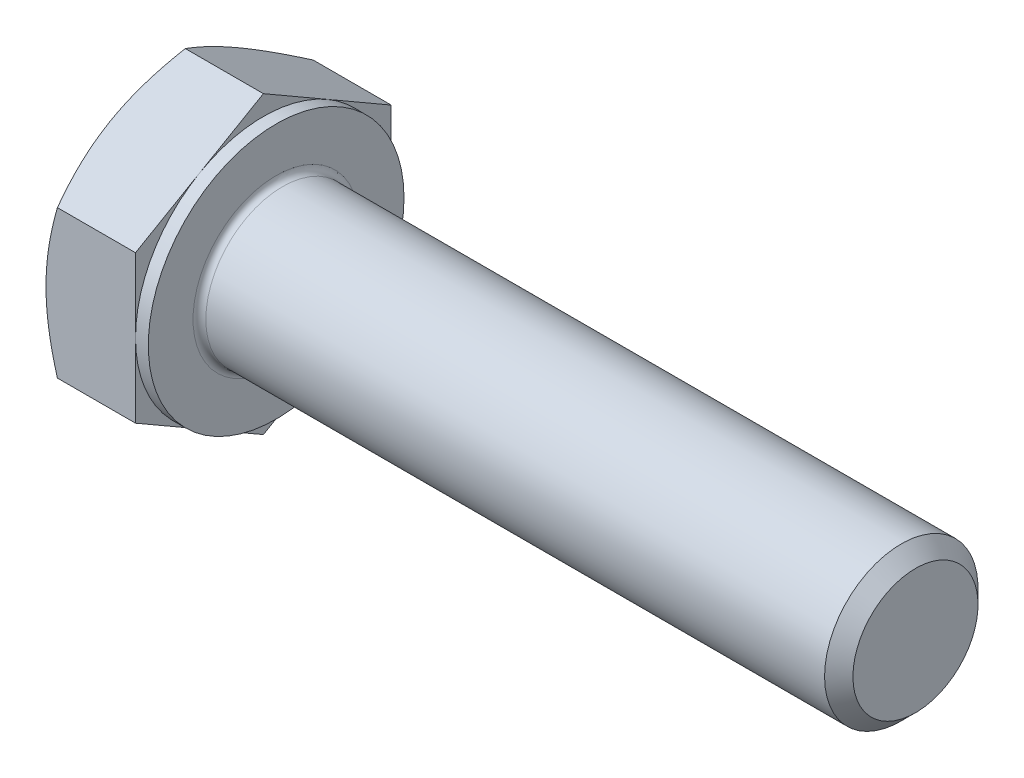
ISO-10303-21;
HEADER;
FILE_DESCRIPTION(('STEP AP214'),'2;1');
FILE_NAME('part.step','',(''),(''),'','','');
FILE_SCHEMA(('AUTOMOTIVE_DESIGN { 1 0 10303 214 1 1 1 1 }'));
ENDSEC;
DATA;
#1=APPLICATION_CONTEXT('core data for automotive mechanical design processes');
#2=APPLICATION_PROTOCOL_DEFINITION('international standard','automotive_design',2000,#1);
#3=PRODUCT_CONTEXT('',#1,'mechanical');
#4=PRODUCT('Part','Part','',(#3));
#5=PRODUCT_RELATED_PRODUCT_CATEGORY('part','',(#4));
#6=PRODUCT_DEFINITION_FORMATION('','',#4);
#7=PRODUCT_DEFINITION_CONTEXT('part definition',#1,'design');
#8=PRODUCT_DEFINITION('design','',#6,#7);
#9=PRODUCT_DEFINITION_SHAPE('','',#8);
#10=(LENGTH_UNIT() NAMED_UNIT(*) SI_UNIT(.MILLI.,.METRE.));
#11=(NAMED_UNIT(*) PLANE_ANGLE_UNIT() SI_UNIT($,.RADIAN.));
#12=(NAMED_UNIT(*) SI_UNIT($,.STERADIAN.) SOLID_ANGLE_UNIT());
#13=UNCERTAINTY_MEASURE_WITH_UNIT(LENGTH_MEASURE(1.E-05),#10,'distance_accuracy_value','');
#14=(GEOMETRIC_REPRESENTATION_CONTEXT(3) GLOBAL_UNCERTAINTY_ASSIGNED_CONTEXT((#13)) GLOBAL_UNIT_ASSIGNED_CONTEXT((#10,
#11,#12)) REPRESENTATION_CONTEXT('',''));
#15=CARTESIAN_POINT('',(0.,0.,0.));
#16=DIRECTION('',(0.,0.,1.));
#17=DIRECTION('',(1.,0.,0.));
#18=AXIS2_PLACEMENT_3D('',#15,#16,#17);
#19=CARTESIAN_POINT('',(4.,5.77350269189627,0.));
#20=DIRECTION('',(1.,0.,0.));
#21=DIRECTION('',(0.,0.,-1.));
#22=AXIS2_PLACEMENT_3D('',#19,#20,#21);
#23=PLANE('',#22);
#24=CARTESIAN_POINT('',(4.,0.,0.));
#25=DIRECTION('',(1.,0.,0.));
#26=DIRECTION('',(0.,0.,-1.));
#27=AXIS2_PLACEMENT_3D('',#24,#25,#26);
#28=CIRCLE('',#27,3.25);
#29=CARTESIAN_POINT('',(4.,0.,-3.25));
#30=VERTEX_POINT('',#29);
#31=EDGE_CURVE('E41',#30,#30,#28,.F.);
#32=ORIENTED_EDGE('',*,*,#31,.T.);
#33=EDGE_LOOP('',(#32));
#34=FACE_BOUND('',#33,.T.);
#35=CARTESIAN_POINT('',(4.,0.,0.));
#36=DIRECTION('',(1.,0.,0.));
#37=DIRECTION('',(0.,0.,-1.));
#38=AXIS2_PLACEMENT_3D('',#35,#36,#37);
#39=CIRCLE('',#38,5.);
#40=CARTESIAN_POINT('',(4.,0.,-5.));
#41=VERTEX_POINT('',#40);
#42=EDGE_CURVE('E292',#41,#41,#39,.T.);
#43=ORIENTED_EDGE('',*,*,#42,.T.);
#44=EDGE_LOOP('',(#43));
#45=FACE_BOUND('',#44,.T.);
#46=ADVANCED_FACE('F33',(#34,#45),#23,.T.);
#47=CARTESIAN_POINT('',(0.,0.,0.));
#48=DIRECTION('',(-1.,0.,0.));
#49=DIRECTION('',(0.,0.,1.));
#50=AXIS2_PLACEMENT_3D('',#47,#48,#49);
#51=CYLINDRICAL_SURFACE('',#50,3.);
#52=CARTESIAN_POINT('',(4.25,0.,0.));
#53=DIRECTION('',(1.,0.,0.));
#54=DIRECTION('',(0.,0.,-1.));
#55=AXIS2_PLACEMENT_3D('',#52,#53,#54);
#56=CIRCLE('',#55,3.);
#57=CARTESIAN_POINT('',(4.25,0.,-3.));
#58=VERTEX_POINT('',#57);
#59=EDGE_CURVE('E11',#58,#58,#56,.T.);
#60=ORIENTED_EDGE('',*,*,#59,.T.);
#61=EDGE_LOOP('',(#60));
#62=FACE_BOUND('',#61,.T.);
#63=CARTESIAN_POINT('',(28.4455,0.,0.));
#64=DIRECTION('',(-1.,0.,0.));
#65=DIRECTION('',(0.,0.,1.));
#66=AXIS2_PLACEMENT_3D('',#63,#64,#65);
#67=CIRCLE('',#66,3.);
#68=CARTESIAN_POINT('',(28.4455,0.,3.));
#69=VERTEX_POINT('',#68);
#70=EDGE_CURVE('E271',#69,#69,#67,.T.);
#71=ORIENTED_EDGE('',*,*,#70,.T.);
#72=EDGE_LOOP('',(#71));
#73=FACE_BOUND('',#72,.T.);
#74=ADVANCED_FACE('F245',(#62,#73),#51,.T.);
#75=CARTESIAN_POINT('',(29.,0.,0.));
#76=DIRECTION('',(-1.,0.,0.));
#77=DIRECTION('',(0.,0.,1.));
#78=AXIS2_PLACEMENT_3D('',#75,#76,#77);
#79=CONICAL_SURFACE('',#78,2.4455,0.785398163397476);
#80=ORIENTED_EDGE('',*,*,#70,.F.);
#81=EDGE_LOOP('',(#80));
#82=FACE_BOUND('',#81,.T.);
#83=CARTESIAN_POINT('',(29.,0.,0.));
#84=DIRECTION('',(-1.,0.,0.));
#85=DIRECTION('',(0.,0.,1.));
#86=AXIS2_PLACEMENT_3D('',#83,#84,#85);
#87=CIRCLE('',#86,2.4455);
#88=CARTESIAN_POINT('',(29.,0.,2.4455));
#89=VERTEX_POINT('',#88);
#90=EDGE_CURVE('E269',#89,#89,#87,.T.);
#91=ORIENTED_EDGE('',*,*,#90,.T.);
#92=EDGE_LOOP('',(#91));
#93=FACE_BOUND('',#92,.T.);
#94=ADVANCED_FACE('F250',(#82,#93),#79,.T.);
#95=CARTESIAN_POINT('',(29.,0.,0.));
#96=DIRECTION('',(-1.,0.,0.));
#97=DIRECTION('',(0.,0.,1.));
#98=AXIS2_PLACEMENT_3D('',#95,#96,#97);
#99=PLANE('',#98);
#100=ORIENTED_EDGE('',*,*,#90,.F.);
#101=EDGE_LOOP('',(#100));
#102=FACE_BOUND('',#101,.T.);
#103=ADVANCED_FACE('F257',(#102),#99,.F.);
#104=CARTESIAN_POINT('',(3.5,5.,0.));
#105=DIRECTION('',(1.,0.,0.));
#106=DIRECTION('',(0.,0.,-1.));
#107=AXIS2_PLACEMENT_3D('',#104,#105,#106);
#108=PLANE('',#107);
#109=DIRECTION('',(0.,0.500000000000001,0.866025403784438));
#110=VECTOR('',#109,1.);
#111=CARTESIAN_POINT('',(3.5,2.88675134594813,-5.));
#112=LINE('',#111,#110);
#113=CARTESIAN_POINT('',(3.5,2.88675134594813,-5.));
#114=VERTEX_POINT('',#113);
#115=CARTESIAN_POINT('',(3.5,4.33012701892219,-2.50000000000001));
#116=VERTEX_POINT('',#115);
#117=EDGE_CURVE('E165',#114,#116,#112,.T.);
#118=ORIENTED_EDGE('',*,*,#117,.T.);
#119=CARTESIAN_POINT('',(3.5,0.,0.));
#120=DIRECTION('',(-1.,0.,0.));
#121=DIRECTION('',(0.,0.,1.));
#122=AXIS2_PLACEMENT_3D('',#119,#120,#121);
#123=CIRCLE('',#122,5.);
#124=CARTESIAN_POINT('',(3.5,0.,-5.));
#125=VERTEX_POINT('',#124);
#126=EDGE_CURVE('E48',#116,#125,#123,.T.);
#127=ORIENTED_EDGE('',*,*,#126,.T.);
#128=DIRECTION('',(0.,1.,0.));
#129=VECTOR('',#128,1.);
#130=CARTESIAN_POINT('',(3.5,2.88675134594813,-5.));
#131=LINE('',#130,#129);
#132=EDGE_CURVE('E295',#125,#114,#131,.T.);
#133=ORIENTED_EDGE('',*,*,#132,.T.);
#134=EDGE_LOOP('',(#118,#127,#133));
#135=FACE_BOUND('',#134,.T.);
#136=ADVANCED_FACE('F260',(#135),#108,.T.);
#137=CARTESIAN_POINT('',(3.5,5.77350269189627,0.));
#138=VERTEX_POINT('',#137);
#139=EDGE_CURVE('E163',#116,#138,#112,.T.);
#140=ORIENTED_EDGE('',*,*,#139,.T.);
#141=DIRECTION('',(0.,-0.500000000000001,0.866025403784438));
#142=VECTOR('',#141,1.);
#143=CARTESIAN_POINT('',(3.5,5.77350269189627,0.));
#144=LINE('',#143,#142);
#145=CARTESIAN_POINT('',(3.5,4.33012701892219,2.5));
#146=VERTEX_POINT('',#145);
#147=EDGE_CURVE('E162',#138,#146,#144,.T.);
#148=ORIENTED_EDGE('',*,*,#147,.T.);
#149=EDGE_CURVE('E151',#146,#116,#123,.T.);
#150=ORIENTED_EDGE('',*,*,#149,.T.);
#151=EDGE_LOOP('',(#140,#148,#150));
#152=FACE_BOUND('',#151,.T.);
#153=ADVANCED_FACE('F265',(#152),#108,.T.);
#154=CARTESIAN_POINT('',(3.5,2.88675134594813,5.));
#155=VERTEX_POINT('',#154);
#156=EDGE_CURVE('E130',#146,#155,#144,.T.);
#157=ORIENTED_EDGE('',*,*,#156,.T.);
#158=DIRECTION('',(0.,-1.,0.));
#159=VECTOR('',#158,1.);
#160=CARTESIAN_POINT('',(3.5,2.88675134594813,5.));
#161=LINE('',#160,#159);
#162=CARTESIAN_POINT('',(3.5,0.,5.));
#163=VERTEX_POINT('',#162);
#164=EDGE_CURVE('E124',#155,#163,#161,.T.);
#165=ORIENTED_EDGE('',*,*,#164,.T.);
#166=EDGE_CURVE('E128',#163,#146,#123,.T.);
#167=ORIENTED_EDGE('',*,*,#166,.T.);
#168=EDGE_LOOP('',(#157,#165,#167));
#169=FACE_BOUND('',#168,.T.);
#170=ADVANCED_FACE('F126',(#169),#108,.T.);
#171=CARTESIAN_POINT('',(3.5,-2.88675134594812,5.));
#172=VERTEX_POINT('',#171);
#173=EDGE_CURVE('E134',#163,#172,#161,.T.);
#174=ORIENTED_EDGE('',*,*,#173,.T.);
#175=DIRECTION('',(0.,-0.500000000000001,-0.866025403784438));
#176=VECTOR('',#175,1.);
#177=CARTESIAN_POINT('',(3.5,-5.77350269189626,0.));
#178=LINE('',#177,#176);
#179=CARTESIAN_POINT('',(3.5,-4.33012701892219,2.50000000000001));
#180=VERTEX_POINT('',#179);
#181=EDGE_CURVE('E141',#172,#180,#178,.T.);
#182=ORIENTED_EDGE('',*,*,#181,.T.);
#183=EDGE_CURVE('E138',#180,#163,#123,.T.);
#184=ORIENTED_EDGE('',*,*,#183,.T.);
#185=EDGE_LOOP('',(#174,#182,#184));
#186=FACE_BOUND('',#185,.T.);
#187=ADVANCED_FACE('F139',(#186),#108,.T.);
#188=CARTESIAN_POINT('',(3.5,-5.77350269189626,0.));
#189=VERTEX_POINT('',#188);
#190=EDGE_CURVE('E157',#180,#189,#178,.T.);
#191=ORIENTED_EDGE('',*,*,#190,.T.);
#192=DIRECTION('',(0.,0.5,-0.866025403784439));
#193=VECTOR('',#192,1.);
#194=CARTESIAN_POINT('',(3.5,-2.88675134594813,-5.));
#195=LINE('',#194,#193);
#196=CARTESIAN_POINT('',(3.5,-4.3301270189222,-2.5));
#197=VERTEX_POINT('',#196);
#198=EDGE_CURVE('E333',#189,#197,#195,.T.);
#199=ORIENTED_EDGE('',*,*,#198,.T.);
#200=EDGE_CURVE('E145',#197,#180,#123,.T.);
#201=ORIENTED_EDGE('',*,*,#200,.T.);
#202=EDGE_LOOP('',(#191,#199,#201));
#203=FACE_BOUND('',#202,.T.);
#204=ADVANCED_FACE('F334',(#203),#108,.T.);
#205=CARTESIAN_POINT('',(3.5,-2.88675134594813,-5.));
#206=VERTEX_POINT('',#205);
#207=EDGE_CURVE('E152',#197,#206,#195,.T.);
#208=ORIENTED_EDGE('',*,*,#207,.T.);
#209=EDGE_CURVE('E296',#206,#125,#131,.T.);
#210=ORIENTED_EDGE('',*,*,#209,.T.);
#211=EDGE_CURVE('E303',#125,#197,#123,.T.);
#212=ORIENTED_EDGE('',*,*,#211,.T.);
#213=EDGE_LOOP('',(#208,#210,#212));
#214=FACE_BOUND('',#213,.T.);
#215=ADVANCED_FACE('F266',(#214),#108,.T.);
#216=CARTESIAN_POINT('',(0.,0.,0.));
#217=DIRECTION('',(-1.,0.,0.));
#218=DIRECTION('',(0.,0.,1.));
#219=AXIS2_PLACEMENT_3D('',#216,#217,#218);
#220=CYLINDRICAL_SURFACE('',#219,5.);
#221=ORIENTED_EDGE('',*,*,#126,.F.);
#222=ORIENTED_EDGE('',*,*,#149,.F.);
#223=ORIENTED_EDGE('',*,*,#166,.F.);
#224=ORIENTED_EDGE('',*,*,#183,.F.);
#225=ORIENTED_EDGE('',*,*,#200,.F.);
#226=ORIENTED_EDGE('',*,*,#211,.F.);
#227=EDGE_LOOP('',(#221,#222,#223,#224,#225,#226));
#228=FACE_BOUND('',#227,.T.);
#229=ORIENTED_EDGE('',*,*,#42,.F.);
#230=EDGE_LOOP('',(#229));
#231=FACE_BOUND('',#230,.T.);
#232=ADVANCED_FACE('F148',(#228,#231),#220,.T.);
#233=CARTESIAN_POINT('',(0.,5.77350269189627,0.));
#234=DIRECTION('',(1.,0.,0.));
#235=DIRECTION('',(0.,0.,-1.));
#236=AXIS2_PLACEMENT_3D('',#233,#234,#235);
#237=PLANE('',#236);
#238=CARTESIAN_POINT('',(0.,0.,0.));
#239=DIRECTION('',(1.,0.,0.));
#240=DIRECTION('',(0.,0.,-1.));
#241=AXIS2_PLACEMENT_3D('',#238,#239,#240);
#242=CIRCLE('',#241,5.);
#243=CARTESIAN_POINT('',(0.,0.,-5.));
#244=VERTEX_POINT('',#243);
#245=CARTESIAN_POINT('',(0.,4.33012701892219,-2.50000000000001));
#246=VERTEX_POINT('',#245);
#247=EDGE_CURVE('E291',#244,#246,#242,.T.);
#248=ORIENTED_EDGE('',*,*,#247,.F.);
#249=CARTESIAN_POINT('',(0.,-4.3301270189222,-2.5));
#250=VERTEX_POINT('',#249);
#251=EDGE_CURVE('E287',#250,#244,#242,.T.);
#252=ORIENTED_EDGE('',*,*,#251,.F.);
#253=CARTESIAN_POINT('',(0.,-4.33012701892219,2.50000000000001));
#254=VERTEX_POINT('',#253);
#255=EDGE_CURVE('E290',#254,#250,#242,.T.);
#256=ORIENTED_EDGE('',*,*,#255,.F.);
#257=CARTESIAN_POINT('',(0.,0.,5.));
#258=VERTEX_POINT('',#257);
#259=EDGE_CURVE('E326',#258,#254,#242,.T.);
#260=ORIENTED_EDGE('',*,*,#259,.F.);
#261=CARTESIAN_POINT('',(0.,0.,0.));
#262=DIRECTION('',(-1.,0.,0.));
#263=DIRECTION('',(0.,0.,1.));
#264=AXIS2_PLACEMENT_3D('',#261,#262,#263);
#265=CIRCLE('',#264,5.);
#266=CARTESIAN_POINT('',(0.,4.33012701892219,2.5));
#267=VERTEX_POINT('',#266);
#268=EDGE_CURVE('E166',#258,#267,#265,.T.);
#269=ORIENTED_EDGE('',*,*,#268,.T.);
#270=EDGE_CURVE('E349',#246,#267,#242,.T.);
#271=ORIENTED_EDGE('',*,*,#270,.F.);
#272=EDGE_LOOP('',(#248,#252,#256,#260,#269,#271));
#273=FACE_BOUND('',#272,.T.);
#274=ADVANCED_FACE('F195',(#273),#237,.F.);
#275=CARTESIAN_POINT('',(0.,0.,0.));
#276=DIRECTION('',(1.,0.,0.));
#277=DIRECTION('',(0.,0.,-1.));
#278=AXIS2_PLACEMENT_3D('',#275,#276,#277);
#279=CONICAL_SURFACE('',#278,5.,1.0471975511966);
#280=CARTESIAN_POINT('',(0.446648656051824,2.88663587589429,5.0002));
#281=CARTESIAN_POINT('',(0.373386567637631,3.01349970319368,4.78046540547481));
#282=CARTESIAN_POINT('',(0.306751321918089,3.14144859993849,4.55885141554042));
#283=CARTESIAN_POINT('',(0.19043899101081,3.39956193532121,4.11178600454649));
#284=CARTESIAN_POINT('',(0.140803049915789,3.52973095989718,3.88632664040923));
#285=CARTESIAN_POINT('',(0.0635510254186988,3.78847564779798,3.43816769477649));
#286=CARTESIAN_POINT('',(0.0354203782834906,3.91701101576052,3.21553790689581));
#287=CARTESIAN_POINT('',(0.0101949219536863,4.11026620624323,2.88081009815336));
#288=CARTESIAN_POINT('',(0.00461345976948592,4.17472868879311,2.76915780319494));
#289=CARTESIAN_POINT('',(-0.000797783248527357,4.30371322717528,2.5457500293262));
#290=CARTESIAN_POINT('',(-0.000627741741793914,4.36823528110589,2.43399455370969));
#291=CARTESIAN_POINT('',(0.00775363179203963,4.54500768479195,2.12781576914936));
#292=CARTESIAN_POINT('',(0.0218297718972545,4.65719946015293,1.93349391403279));
#293=CARTESIAN_POINT('',(0.0664652571094336,4.88083840557982,1.54613989800229));
#294=CARTESIAN_POINT('',(0.0970398601475108,4.99228478956021,1.35310909862843));
#295=CARTESIAN_POINT('',(0.173468493621166,5.21637431361296,0.964974657525145));
#296=CARTESIAN_POINT('',(0.219646378878682,5.32898917185759,0.769920001358264));
#297=CARTESIAN_POINT('',(0.324451794491935,5.55253939626499,0.382719654641231));
#298=CARTESIAN_POINT('',(0.383054703437375,5.66347762579593,0.190569004591913));
#299=CARTESIAN_POINT('',(0.446648656051829,5.7736181619501,-0.000200000000000198));
#300=B_SPLINE_CURVE_WITH_KNOTS('',3,(#280,#281,#282,#283,#284,#285,#286,#287,#288,#289,#290,
#291,#292,#293,#294,#295,#296,#297,#298,#299),.UNSPECIFIED.,.F.,.F.,(4,2,2,2,2,2,2,2,2,4),(0.,
0.79255584136309,1.58701660053333,2.3618153748728,2.74884076077325,3.13585419177295,
3.80962362599679,4.48401723901189,5.17336882348929,5.86136694793725),.UNSPECIFIED.);
#301=CARTESIAN_POINT('',(0.446581987385202,5.77350269189627,0.));
#302=VERTEX_POINT('',#301);
#303=EDGE_CURVE('E214',#267,#302,#300,.T.);
#304=ORIENTED_EDGE('',*,*,#303,.T.);
#305=CARTESIAN_POINT('',(0.446648656051829,5.7736181619501,0.0002));
#306=CARTESIAN_POINT('',(0.373386567637635,5.64675433465071,-0.219534594525185));
#307=CARTESIAN_POINT('',(0.306751321918093,5.5188054379059,-0.44114858445958));
#308=CARTESIAN_POINT('',(0.190438991010812,5.26069210252319,-0.888213995453513));
#309=CARTESIAN_POINT('',(0.140803049915791,5.13052307794722,-1.11367335959077));
#310=CARTESIAN_POINT('',(0.0635510254187,4.87177839004642,-1.56183230522351));
#311=CARTESIAN_POINT('',(0.0354203782834913,4.74324302208387,-1.78446209310419));
#312=CARTESIAN_POINT('',(0.0101949219536861,4.54998783160117,-2.11918990184664));
#313=CARTESIAN_POINT('',(0.00461345976948539,4.48552534905128,-2.23084219680506));
#314=CARTESIAN_POINT('',(-0.000797783248528581,4.35654081066911,-2.4542499706738));
#315=CARTESIAN_POINT('',(-0.000627741741795494,4.2920187567385,-2.56600544629031));
#316=CARTESIAN_POINT('',(0.00775363179203722,4.11524635305245,-2.87218423085064));
#317=CARTESIAN_POINT('',(0.0218297718972517,4.00305457769146,-3.06650608596721));
#318=CARTESIAN_POINT('',(0.06646525710943,3.77941563226458,-3.4538601019977));
#319=CARTESIAN_POINT('',(0.0970398601475067,3.66796924828419,-3.64689090137157));
#320=CARTESIAN_POINT('',(0.173468493621161,3.44387972423144,-4.03502534247485));
#321=CARTESIAN_POINT('',(0.219646378878677,3.3312648659868,-4.23007999864173));
#322=CARTESIAN_POINT('',(0.32445179449193,3.1077146415794,-4.61728034535877));
#323=CARTESIAN_POINT('',(0.38305470343737,2.99677641204847,-4.80943099540809));
#324=CARTESIAN_POINT('',(0.446648656051823,2.88663587589429,-5.0002));
#325=B_SPLINE_CURVE_WITH_KNOTS('',3,(#305,#306,#307,#308,#309,#310,#311,#312,#313,#314,#315,
#316,#317,#318,#319,#320,#321,#322,#323,#324),.UNSPECIFIED.,.F.,.F.,(4,2,2,2,2,2,2,2,2,4),(0.,
0.792555841363091,1.58701660053333,2.36181537487281,2.74884076077325,3.13585419177295,
3.80962362599679,4.48401723901189,5.17336882348929,5.86136694793726),.UNSPECIFIED.);
#326=EDGE_CURVE('E56',#302,#246,#325,.T.);
#327=ORIENTED_EDGE('',*,*,#326,.T.);
#328=ORIENTED_EDGE('',*,*,#270,.T.);
#329=EDGE_LOOP('',(#304,#327,#328));
#330=FACE_BOUND('',#329,.T.);
#331=ADVANCED_FACE('F350',(#330),#279,.T.);
#332=CARTESIAN_POINT('',(2.47533544773016,-7.82661640485965,5.));
#333=CARTESIAN_POINT('',(2.36879683587998,-7.60758613191207,5.));
#334=CARTESIAN_POINT('',(2.26325911909788,-7.38806071524902,5.));
#335=CARTESIAN_POINT('',(2.05474707935713,-6.94775649684318,5.));
#336=CARTESIAN_POINT('',(1.95177314683289,-6.72697751040761,5.));
#337=CARTESIAN_POINT('',(1.74844778604607,-6.28280027256957,5.));
#338=CARTESIAN_POINT('',(1.64811306546723,-6.05939434718171,5.));
#339=CARTESIAN_POINT('',(1.45145486053268,-5.61083043946535,5.));
#340=CARTESIAN_POINT('',(1.35513119126153,-5.38567253847477,5.));
#341=CARTESIAN_POINT('',(1.1644503764456,-4.92576614875536,5.));
#342=CARTESIAN_POINT('',(1.07026351441087,-4.69094667948417,5.));
#343=CARTESIAN_POINT('',(0.888844387633462,-4.21858752811389,5.));
#344=CARTESIAN_POINT('',(0.801612892890075,-3.9810475481584,5.));
#345=CARTESIAN_POINT('',(0.636341072069415,-3.50329086460757,5.));
#346=CARTESIAN_POINT('',(0.558282765305846,-3.26308044300255,5.));
#347=CARTESIAN_POINT('',(0.413813856838623,-2.77921467855871,5.));
#348=CARTESIAN_POINT('',(0.347399663707793,-2.53556042305534,5.));
#349=CARTESIAN_POINT('',(0.229707450560144,-2.04600448324932,5.));
#350=CARTESIAN_POINT('',(0.178346573443934,-1.80012308688264,5.));
#351=CARTESIAN_POINT('',(0.093623080463316,-1.30522837475499,5.));
#352=CARTESIAN_POINT('',(0.0602585788862637,-1.05621538993014,5.));
#353=CARTESIAN_POINT('',(0.0146229933450839,-0.559584253278225,5.));
#354=CARTESIAN_POINT('',(0.00207498504095024,-0.31199219235863,5.));
#355=CARTESIAN_POINT('',(-0.00159747163599477,0.183375584872594,5.));
#356=CARTESIAN_POINT('',(0.0072784945238692,0.431151304645104,5.));
#357=CARTESIAN_POINT('',(0.039726505421477,0.849622861805596,5.));
#358=CARTESIAN_POINT('',(0.0579847913857286,1.02075746651639,5.));
#359=CARTESIAN_POINT('',(0.103624050167705,1.36181398870372,5.));
#360=CARTESIAN_POINT('',(0.131006199278085,1.53173574692746,5.));
#361=CARTESIAN_POINT('',(0.225403334084526,2.03942834664789,5.));
#362=CARTESIAN_POINT('',(0.304653621421582,2.37495177296715,5.));
#363=CARTESIAN_POINT('',(0.442611792559002,2.87686006155707,5.));
#364=CARTESIAN_POINT('',(0.49245303634292,3.04583048720641,5.));
#365=CARTESIAN_POINT('',(0.597441969943082,3.38213061181747,5.));
#366=CARTESIAN_POINT('',(0.652589699263443,3.5494602985545,5.));
#367=CARTESIAN_POINT('',(0.767295730539584,3.88253122492365,5.));
#368=CARTESIAN_POINT('',(0.826852713693853,4.04827292290387,5.));
#369=CARTESIAN_POINT('',(0.949663499711002,4.37837269762154,5.));
#370=CARTESIAN_POINT('',(1.01291722698938,4.54273080256971,5.));
#371=CARTESIAN_POINT('',(1.18384085372924,4.9746759420168,5.));
#372=CARTESIAN_POINT('',(1.29410564850766,5.24123504417618,5.));
#373=CARTESIAN_POINT('',(1.52085041273531,5.77170603685541,5.));
#374=CARTESIAN_POINT('',(1.63733099875866,6.03561766166314,5.));
#375=CARTESIAN_POINT('',(1.87507624465413,6.56138078935166,5.));
#376=CARTESIAN_POINT('',(1.99634255400967,6.82323154395423,5.));
#377=CARTESIAN_POINT('',(2.24254703935561,7.34518395756719,5.));
#378=CARTESIAN_POINT('',(2.36748508274946,7.60528567932422,5.));
#379=CARTESIAN_POINT('',(2.62044102963033,8.1244647881268,5.));
#380=CARTESIAN_POINT('',(2.74846325137578,8.38354006704557,5.));
#381=CARTESIAN_POINT('',(3.00682669043527,8.90053291278445,5.));
#382=CARTESIAN_POINT('',(3.1371679315062,9.15845046771048,5.));
#383=CARTESIAN_POINT('',(3.53092424668021,9.93067662423609,5.));
#384=CARTESIAN_POINT('',(3.79712405249167,10.443564725279,5.));
#385=CARTESIAN_POINT('',(4.30724046958686,11.4147548726185,5.));
#386=CARTESIAN_POINT('',(4.55067498840221,11.8733113497712,5.));
#387=CARTESIAN_POINT('',(5.04052915864102,12.7888590482936,5.));
#388=CARTESIAN_POINT('',(5.28694897561914,13.2458501810352,5.));
#389=CARTESIAN_POINT('',(5.78122505426356,14.1571829404852,5.));
#390=CARTESIAN_POINT('',(6.02907430541541,14.6115283754435,5.));
#391=CARTESIAN_POINT('',(6.52648185600864,15.519239876133,5.));
#392=CARTESIAN_POINT('',(6.77604002891258,15.9726060111757,5.));
#393=CARTESIAN_POINT('',(7.02622264640792,16.4256251058944,4.99999999999999));
#394=B_SPLINE_CURVE_WITH_KNOTS('',3,(#332,#333,#334,#335,#336,#337,#338,#339,#340,#341,#342,
#343,#344,#345,#346,#347,#348,#349,#350,#351,#352,#353,#354,#355,#356,#357,#358,#359,#360,#361,
#362,#363,#364,#365,#366,#367,#368,#369,#370,#371,#372,#373,#374,#375,#376,#377,#378,#379,#380,
#381,#382,#383,#384,#385,#386,#387,#388,#389,#390,#391,#392,#393),.UNSPECIFIED.,.F.,.F.,(4,2,2,
2,2,2,2,2,2,2,2,2,2,2,2,2,2,2,2,2,2,2,2,2,2,2,2,2,2,2,4),(0.,0.730708682345171,1.46152797074168,
2.19620403713771,2.93084619629067,3.6897749176122,4.4487875404052,5.20628666357255,
5.96355173652934,6.71656679685728,7.46950293873849,8.21233991499823,8.95519126453254,
9.4712599153487,9.98739512599664,11.0201893970363,11.5486465448551,12.0771076270762,
12.6054112809942,13.1337041368682,13.9989833756252,14.8643486057043,15.7300147495654,
16.5956496701284,17.4625765104337,18.329512236973,20.0630293199505,21.6205191254926,
23.178095703244,24.7307447740735,26.2832800957379),.UNSPECIFIED.);
#395=CARTESIAN_POINT('',(0.446581987385198,2.88675134594813,5.));
#396=VERTEX_POINT('',#395);
#397=EDGE_CURVE('E226',#258,#396,#394,.T.);
#398=ORIENTED_EDGE('',*,*,#397,.T.);
#399=EDGE_CURVE('E225',#396,#267,#300,.T.);
#400=ORIENTED_EDGE('',*,*,#399,.T.);
#401=ORIENTED_EDGE('',*,*,#268,.F.);
#402=EDGE_LOOP('',(#398,#400,#401));
#403=FACE_BOUND('',#402,.T.);
#404=ADVANCED_FACE('F320',(#403),#279,.T.);
#405=CARTESIAN_POINT('',(0.446581987385197,-2.88675134594812,5.));
#406=VERTEX_POINT('',#405);
#407=EDGE_CURVE('E272',#406,#258,#394,.T.);
#408=ORIENTED_EDGE('',*,*,#407,.T.);
#409=ORIENTED_EDGE('',*,*,#259,.T.);
#410=CARTESIAN_POINT('',(0.446648656051827,-5.7736181619501,-0.000199999999999531));
#411=CARTESIAN_POINT('',(0.373386567637634,-5.64675433465071,0.219534594525185));
#412=CARTESIAN_POINT('',(0.306751321918091,-5.5188054379059,0.44114858445958));
#413=CARTESIAN_POINT('',(0.19043899101081,-5.26069210252318,0.888213995453512));
#414=CARTESIAN_POINT('',(0.140803049915788,-5.13052307794721,1.11367335959077));
#415=CARTESIAN_POINT('',(0.0635510254186979,-4.87177839004641,1.56183230522351));
#416=CARTESIAN_POINT('',(0.0354203782834897,-4.74324302208387,1.78446209310419));
#417=CARTESIAN_POINT('',(0.0101949219536844,-4.54998783160116,2.11918990184664));
#418=CARTESIAN_POINT('',(0.00461345976948357,-4.48552534905128,2.23084219680506));
#419=CARTESIAN_POINT('',(-0.000797783248530274,-4.35654081066911,2.4542499706738));
#420=CARTESIAN_POINT('',(-0.000627741741796871,-4.2920187567385,2.56600544629031));
#421=CARTESIAN_POINT('',(0.00775363179203619,-4.11524635305244,2.87218423085064));
#422=CARTESIAN_POINT('',(0.0218297718972503,-4.00305457769146,3.06650608596721));
#423=CARTESIAN_POINT('',(0.0664652571094285,-3.77941563226457,3.4538601019977));
#424=CARTESIAN_POINT('',(0.0970398601475055,-3.66796924828418,3.64689090137157));
#425=CARTESIAN_POINT('',(0.173468493621161,-3.44387972423144,4.03502534247485));
#426=CARTESIAN_POINT('',(0.219646378878676,-3.3312648659868,4.23007999864173));
#427=CARTESIAN_POINT('',(0.32445179449193,-3.1077146415794,4.61728034535877));
#428=CARTESIAN_POINT('',(0.383054703437369,-2.99677641204846,4.80943099540809));
#429=CARTESIAN_POINT('',(0.446648656051823,-2.88663587589429,5.0002));
#430=B_SPLINE_CURVE_WITH_KNOTS('',3,(#410,#411,#412,#413,#414,#415,#416,#417,#418,#419,#420,
#421,#422,#423,#424,#425,#426,#427,#428,#429),.UNSPECIFIED.,.F.,.F.,(4,2,2,2,2,2,2,2,2,4),(0.,
0.79255584136309,1.58701660053333,2.3618153748728,2.74884076077325,3.13585419177295,
3.80962362599679,4.48401723901189,5.17336882348929,5.86136694793726),.UNSPECIFIED.);
#431=EDGE_CURVE('E216',#254,#406,#430,.T.);
#432=ORIENTED_EDGE('',*,*,#431,.T.);
#433=EDGE_LOOP('',(#408,#409,#432));
#434=FACE_BOUND('',#433,.T.);
#435=ADVANCED_FACE('F184',(#434),#279,.T.);
#436=CARTESIAN_POINT('',(0.4465819873852,-5.77350269189626,0.));
#437=VERTEX_POINT('',#436);
#438=EDGE_CURVE('E209',#437,#254,#430,.T.);
#439=ORIENTED_EDGE('',*,*,#438,.T.);
#440=ORIENTED_EDGE('',*,*,#255,.T.);
#441=CARTESIAN_POINT('',(0.446648656051827,-2.8866358758943,-5.0002));
#442=CARTESIAN_POINT('',(0.373386567637634,-3.01349970319368,-4.78046540547482));
#443=CARTESIAN_POINT('',(0.306751321918091,-3.1414485999385,-4.55885141554042));
#444=CARTESIAN_POINT('',(0.190438991010811,-3.39956193532121,-4.11178600454649));
#445=CARTESIAN_POINT('',(0.14080304991579,-3.52973095989718,-3.88632664040923));
#446=CARTESIAN_POINT('',(0.0635510254186998,-3.78847564779798,-3.43816769477649));
#447=CARTESIAN_POINT('',(0.0354203782834917,-3.91701101576052,-3.21553790689581));
#448=CARTESIAN_POINT('',(0.0101949219536868,-4.11026620624323,-2.88081009815336));
#449=CARTESIAN_POINT('',(0.00461345976948619,-4.17472868879311,-2.76915780319494));
#450=CARTESIAN_POINT('',(-0.00079778324852763,-4.30371322717528,-2.5457500293262));
#451=CARTESIAN_POINT('',(-0.000627741741794428,-4.36823528110589,-2.43399455370969));
#452=CARTESIAN_POINT('',(0.0077536317920388,-4.54500768479195,-2.12781576914936));
#453=CARTESIAN_POINT('',(0.0218297718972538,-4.65719946015293,-1.93349391403279));
#454=CARTESIAN_POINT('',(0.0664652571094329,-4.88083840557982,-1.5461398980023));
#455=CARTESIAN_POINT('',(0.0970398601475099,-4.99228478956021,-1.35310909862843));
#456=CARTESIAN_POINT('',(0.173468493621165,-5.21637431361295,-0.964974657525146));
#457=CARTESIAN_POINT('',(0.21964637887868,-5.32898917185759,-0.769920001358265));
#458=CARTESIAN_POINT('',(0.324451794491933,-5.55253939626499,-0.382719654641231));
#459=CARTESIAN_POINT('',(0.383054703437373,-5.66347762579592,-0.190569004591913));
#460=CARTESIAN_POINT('',(0.446648656051827,-5.7736181619501,0.000200000000000355));
#461=B_SPLINE_CURVE_WITH_KNOTS('',3,(#441,#442,#443,#444,#445,#446,#447,#448,#449,#450,#451,
#452,#453,#454,#455,#456,#457,#458,#459,#460),.UNSPECIFIED.,.F.,.F.,(4,2,2,2,2,2,2,2,2,4),(0.,
0.792555841363091,1.58701660053333,2.3618153748728,2.74884076077325,3.13585419177295,
3.80962362599679,4.48401723901189,5.17336882348929,5.86136694793725),.UNSPECIFIED.);
#462=EDGE_CURVE('E215',#250,#437,#461,.T.);
#463=ORIENTED_EDGE('',*,*,#462,.T.);
#464=EDGE_LOOP('',(#439,#440,#463));
#465=FACE_BOUND('',#464,.T.);
#466=ADVANCED_FACE('F348',(#465),#279,.T.);
#467=CARTESIAN_POINT('',(0.446581987385197,2.88675134594813,-5.));
#468=VERTEX_POINT('',#467);
#469=EDGE_CURVE('E217',#246,#468,#325,.T.);
#470=ORIENTED_EDGE('',*,*,#469,.T.);
#471=CARTESIAN_POINT('',(2.47533544773016,-7.82661640485967,-5.));
#472=CARTESIAN_POINT('',(2.36879683587999,-7.60758613191209,-5.));
#473=CARTESIAN_POINT('',(2.26325911909789,-7.38806071524903,-5.));
#474=CARTESIAN_POINT('',(2.05474707935714,-6.9477564968432,-5.));
#475=CARTESIAN_POINT('',(1.9517731468329,-6.72697751040762,-5.));
#476=CARTESIAN_POINT('',(1.74844778604607,-6.28280027256958,-5.));
#477=CARTESIAN_POINT('',(1.64811306546723,-6.05939434718172,-5.));
#478=CARTESIAN_POINT('',(1.45145486053269,-5.61083043946536,-5.));
#479=CARTESIAN_POINT('',(1.35513119126154,-5.38567253847479,-5.));
#480=CARTESIAN_POINT('',(1.16445037644561,-4.92576614875537,-5.));
#481=CARTESIAN_POINT('',(1.07026351441088,-4.69094667948418,-5.));
#482=CARTESIAN_POINT('',(0.888844387633467,-4.21858752811391,-5.));
#483=CARTESIAN_POINT('',(0.80161289289008,-3.98104754815841,-5.));
#484=CARTESIAN_POINT('',(0.63634107206942,-3.50329086460758,-5.));
#485=CARTESIAN_POINT('',(0.55828276530585,-3.26308044300257,-5.));
#486=CARTESIAN_POINT('',(0.413813856838626,-2.77921467855872,-5.));
#487=CARTESIAN_POINT('',(0.347399663707796,-2.53556042305535,-5.));
#488=CARTESIAN_POINT('',(0.229707450560147,-2.04600448324933,-5.));
#489=CARTESIAN_POINT('',(0.178346573443937,-1.80012308688265,-5.));
#490=CARTESIAN_POINT('',(0.0936230804633182,-1.305228374755,-5.));
#491=CARTESIAN_POINT('',(0.0602585788862654,-1.05621538993014,-5.));
#492=CARTESIAN_POINT('',(0.0146229933450852,-0.559584253278234,-5.));
#493=CARTESIAN_POINT('',(0.00207498504095155,-0.311992192358638,-5.));
#494=CARTESIAN_POINT('',(-0.00159747163599407,0.183375584872586,-5.));
#495=CARTESIAN_POINT('',(0.00727849452386931,0.431151304645096,-5.));
#496=CARTESIAN_POINT('',(0.0397265054214769,0.849622861805588,-5.));
#497=CARTESIAN_POINT('',(0.0579847913857286,1.02075746651638,-5.));
#498=CARTESIAN_POINT('',(0.103624050167705,1.36181398870371,-5.));
#499=CARTESIAN_POINT('',(0.131006199278085,1.53173574692745,-5.));
#500=CARTESIAN_POINT('',(0.225403334084526,2.03942834664788,-5.));
#501=CARTESIAN_POINT('',(0.304653621421582,2.37495177296714,-5.));
#502=CARTESIAN_POINT('',(0.442611792559001,2.87686006155706,-5.));
#503=CARTESIAN_POINT('',(0.492453036342918,3.0458304872064,-5.));
#504=CARTESIAN_POINT('',(0.59744196994308,3.38213061181747,-5.));
#505=CARTESIAN_POINT('',(0.652589699263441,3.5494602985545,-5.));
#506=CARTESIAN_POINT('',(0.767295730539582,3.88253122492364,-5.));
#507=CARTESIAN_POINT('',(0.826852713693851,4.04827292290386,-5.));
#508=CARTESIAN_POINT('',(0.949663499710999,4.37837269762153,-5.));
#509=CARTESIAN_POINT('',(1.01291722698938,4.5427308025697,-5.));
#510=CARTESIAN_POINT('',(1.18384085372924,4.9746759420168,-5.));
#511=CARTESIAN_POINT('',(1.29410564850766,5.24123504417617,-5.));
#512=CARTESIAN_POINT('',(1.5208504127353,5.7717060368554,-5.));
#513=CARTESIAN_POINT('',(1.63733099875865,6.03561766166313,-5.));
#514=CARTESIAN_POINT('',(1.87507624465413,6.56138078935165,-5.));
#515=CARTESIAN_POINT('',(1.99634255400967,6.82323154395422,-5.));
#516=CARTESIAN_POINT('',(2.24254703935561,7.34518395756718,-5.));
#517=CARTESIAN_POINT('',(2.36748508274945,7.60528567932421,-5.));
#518=CARTESIAN_POINT('',(2.62044102963033,8.12446478812679,-5.));
#519=CARTESIAN_POINT('',(2.74846325137577,8.38354006704556,-5.));
#520=CARTESIAN_POINT('',(3.00682669043527,8.90053291278444,-5.));
#521=CARTESIAN_POINT('',(3.1371679315062,9.15845046771047,-5.));
#522=CARTESIAN_POINT('',(3.53092424668021,9.93067662423608,-5.));
#523=CARTESIAN_POINT('',(3.79712405249167,10.443564725279,-5.));
#524=CARTESIAN_POINT('',(4.30724046958686,11.4147548726185,-5.));
#525=CARTESIAN_POINT('',(4.55067498840221,11.8733113497711,-5.));
#526=CARTESIAN_POINT('',(5.04052915864102,12.7888590482936,-5.));
#527=CARTESIAN_POINT('',(5.28694897561914,13.2458501810352,-5.));
#528=CARTESIAN_POINT('',(5.78122505426356,14.1571829404852,-5.));
#529=CARTESIAN_POINT('',(6.02907430541541,14.6115283754435,-5.));
#530=CARTESIAN_POINT('',(6.52648185600864,15.519239876133,-5.));
#531=CARTESIAN_POINT('',(6.77604002891258,15.9726060111757,-5.));
#532=CARTESIAN_POINT('',(7.02622264640792,16.4256251058944,-5.));
#533=B_SPLINE_CURVE_WITH_KNOTS('',3,(#471,#472,#473,#474,#475,#476,#477,#478,#479,#480,#481,
#482,#483,#484,#485,#486,#487,#488,#489,#490,#491,#492,#493,#494,#495,#496,#497,#498,#499,#500,
#501,#502,#503,#504,#505,#506,#507,#508,#509,#510,#511,#512,#513,#514,#515,#516,#517,#518,#519,
#520,#521,#522,#523,#524,#525,#526,#527,#528,#529,#530,#531,#532),.UNSPECIFIED.,.F.,.F.,(4,2,2,
2,2,2,2,2,2,2,2,2,2,2,2,2,2,2,2,2,2,2,2,2,2,2,2,2,2,2,4),(0.,0.730708682345172,1.46152797074168,
2.19620403713772,2.93084619629067,3.6897749176122,4.4487875404052,5.20628666357255,
5.96355173652935,6.71656679685729,7.4695029387385,8.21233991499824,8.95519126453255,
9.4712599153487,9.98739512599665,11.0201893970363,11.5486465448551,12.0771076270762,
12.6054112809943,13.1337041368682,13.9989833756253,14.8643486057044,15.7300147495654,
16.5956496701284,17.4625765104337,18.329512236973,20.0630293199506,21.6205191254926,
23.178095703244,24.7307447740736,26.2832800957379),.UNSPECIFIED.);
#534=EDGE_CURVE('E177',#468,#244,#533,.F.);
#535=ORIENTED_EDGE('',*,*,#534,.T.);
#536=ORIENTED_EDGE('',*,*,#247,.T.);
#537=EDGE_LOOP('',(#470,#535,#536));
#538=FACE_BOUND('',#537,.T.);
#539=ADVANCED_FACE('F345',(#538),#279,.T.);
#540=CARTESIAN_POINT('',(0.446581987384946,-2.88675134594852,-5.));
#541=VERTEX_POINT('',#540);
#542=EDGE_CURVE('E178',#541,#250,#461,.T.);
#543=ORIENTED_EDGE('',*,*,#542,.T.);
#544=ORIENTED_EDGE('',*,*,#251,.T.);
#545=EDGE_CURVE('E169',#244,#541,#533,.F.);
#546=ORIENTED_EDGE('',*,*,#545,.T.);
#547=EDGE_LOOP('',(#543,#544,#546));
#548=FACE_BOUND('',#547,.T.);
#549=ADVANCED_FACE('F193',(#548),#279,.T.);
#550=CARTESIAN_POINT('',(4.,2.88675134594813,-5.));
#551=DIRECTION('',(0.,0.,1.));
#552=DIRECTION('',(0.,-1.,0.));
#553=AXIS2_PLACEMENT_3D('',#550,#551,#552);
#554=PLANE('',#553);
#555=ORIENTED_EDGE('',*,*,#209,.F.);
#556=DIRECTION('',(-1.,0.,0.));
#557=VECTOR('',#556,1.);
#558=CARTESIAN_POINT('',(4.,-2.88675134594813,-5.));
#559=LINE('',#558,#557);
#560=EDGE_CURVE('E278',#206,#541,#559,.T.);
#561=ORIENTED_EDGE('',*,*,#560,.T.);
#562=ORIENTED_EDGE('',*,*,#545,.F.);
#563=ORIENTED_EDGE('',*,*,#534,.F.);
#564=DIRECTION('',(-1.,0.,0.));
#565=VECTOR('',#564,1.);
#566=CARTESIAN_POINT('',(4.,2.88675134594813,-5.));
#567=LINE('',#566,#565);
#568=EDGE_CURVE('E274',#114,#468,#567,.T.);
#569=ORIENTED_EDGE('',*,*,#568,.F.);
#570=ORIENTED_EDGE('',*,*,#132,.F.);
#571=EDGE_LOOP('',(#555,#561,#562,#563,#569,#570));
#572=FACE_BOUND('',#571,.T.);
#573=ADVANCED_FACE('F188',(#572),#554,.F.);
#574=CARTESIAN_POINT('',(4.,-2.88675134594813,-5.));
#575=DIRECTION('',(0.,0.866025403784439,0.5));
#576=DIRECTION('',(0.,-0.5,0.866025403784439));
#577=AXIS2_PLACEMENT_3D('',#574,#575,#576);
#578=PLANE('',#577);
#579=ORIENTED_EDGE('',*,*,#198,.F.);
#580=DIRECTION('',(-1.,0.,0.));
#581=VECTOR('',#580,1.);
#582=CARTESIAN_POINT('',(4.,-5.77350269189626,0.));
#583=LINE('',#582,#581);
#584=EDGE_CURVE('E280',#189,#437,#583,.T.);
#585=ORIENTED_EDGE('',*,*,#584,.T.);
#586=ORIENTED_EDGE('',*,*,#462,.F.);
#587=ORIENTED_EDGE('',*,*,#542,.F.);
#588=ORIENTED_EDGE('',*,*,#560,.F.);
#589=ORIENTED_EDGE('',*,*,#207,.F.);
#590=EDGE_LOOP('',(#579,#585,#586,#587,#588,#589));
#591=FACE_BOUND('',#590,.T.);
#592=ADVANCED_FACE('F192',(#591),#578,.F.);
#593=CARTESIAN_POINT('',(4.,-5.77350269189626,0.));
#594=DIRECTION('',(0.,0.866025403784438,-0.500000000000001));
#595=DIRECTION('',(0.,0.500000000000001,0.866025403784438));
#596=AXIS2_PLACEMENT_3D('',#593,#594,#595);
#597=PLANE('',#596);
#598=ORIENTED_EDGE('',*,*,#181,.F.);
#599=DIRECTION('',(-1.,0.,0.));
#600=VECTOR('',#599,1.);
#601=CARTESIAN_POINT('',(4.,-2.88675134594812,5.));
#602=LINE('',#601,#600);
#603=EDGE_CURVE('E156',#172,#406,#602,.T.);
#604=ORIENTED_EDGE('',*,*,#603,.T.);
#605=ORIENTED_EDGE('',*,*,#431,.F.);
#606=ORIENTED_EDGE('',*,*,#438,.F.);
#607=ORIENTED_EDGE('',*,*,#584,.F.);
#608=ORIENTED_EDGE('',*,*,#190,.F.);
#609=EDGE_LOOP('',(#598,#604,#605,#606,#607,#608));
#610=FACE_BOUND('',#609,.T.);
#611=ADVANCED_FACE('F200',(#610),#597,.F.);
#612=CARTESIAN_POINT('',(4.,2.88675134594813,5.));
#613=DIRECTION('',(0.,0.,-1.));
#614=DIRECTION('',(0.,1.,0.));
#615=AXIS2_PLACEMENT_3D('',#612,#613,#614);
#616=PLANE('',#615);
#617=ORIENTED_EDGE('',*,*,#164,.F.);
#618=DIRECTION('',(-1.,0.,0.));
#619=VECTOR('',#618,1.);
#620=CARTESIAN_POINT('',(4.,2.88675134594813,5.));
#621=LINE('',#620,#619);
#622=EDGE_CURVE('E283',#155,#396,#621,.T.);
#623=ORIENTED_EDGE('',*,*,#622,.T.);
#624=ORIENTED_EDGE('',*,*,#397,.F.);
#625=ORIENTED_EDGE('',*,*,#407,.F.);
#626=ORIENTED_EDGE('',*,*,#603,.F.);
#627=ORIENTED_EDGE('',*,*,#173,.F.);
#628=EDGE_LOOP('',(#617,#623,#624,#625,#626,#627));
#629=FACE_BOUND('',#628,.T.);
#630=ADVANCED_FACE('F154',(#629),#616,.F.);
#631=CARTESIAN_POINT('',(4.,5.77350269189627,0.));
#632=DIRECTION('',(0.,-0.866025403784438,-0.500000000000001));
#633=DIRECTION('',(0.,0.500000000000001,-0.866025403784438));
#634=AXIS2_PLACEMENT_3D('',#631,#632,#633);
#635=PLANE('',#634);
#636=ORIENTED_EDGE('',*,*,#147,.F.);
#637=DIRECTION('',(-1.,0.,0.));
#638=VECTOR('',#637,1.);
#639=CARTESIAN_POINT('',(4.,5.77350269189627,0.));
#640=LINE('',#639,#638);
#641=EDGE_CURVE('E285',#138,#302,#640,.T.);
#642=ORIENTED_EDGE('',*,*,#641,.T.);
#643=ORIENTED_EDGE('',*,*,#303,.F.);
#644=ORIENTED_EDGE('',*,*,#399,.F.);
#645=ORIENTED_EDGE('',*,*,#622,.F.);
#646=ORIENTED_EDGE('',*,*,#156,.F.);
#647=EDGE_LOOP('',(#636,#642,#643,#644,#645,#646));
#648=FACE_BOUND('',#647,.T.);
#649=ADVANCED_FACE('F231',(#648),#635,.F.);
#650=CARTESIAN_POINT('',(4.,2.88675134594813,-5.));
#651=DIRECTION('',(0.,-0.866025403784438,0.500000000000001));
#652=DIRECTION('',(0.,-0.500000000000001,-0.866025403784438));
#653=AXIS2_PLACEMENT_3D('',#650,#651,#652);
#654=PLANE('',#653);
#655=ORIENTED_EDGE('',*,*,#117,.F.);
#656=ORIENTED_EDGE('',*,*,#568,.T.);
#657=ORIENTED_EDGE('',*,*,#469,.F.);
#658=ORIENTED_EDGE('',*,*,#326,.F.);
#659=ORIENTED_EDGE('',*,*,#641,.F.);
#660=ORIENTED_EDGE('',*,*,#139,.F.);
#661=EDGE_LOOP('',(#655,#656,#657,#658,#659,#660));
#662=FACE_BOUND('',#661,.T.);
#663=ADVANCED_FACE('F234',(#662),#654,.F.);
#664=CARTESIAN_POINT('',(4.25,0.,0.));
#665=DIRECTION('',(1.,0.,0.));
#666=DIRECTION('',(0.,0.,-1.));
#667=AXIS2_PLACEMENT_3D('',#664,#665,#666);
#668=TOROIDAL_SURFACE('',#667,3.25,0.25);
#669=ORIENTED_EDGE('',*,*,#59,.F.);
#670=EDGE_LOOP('',(#669));
#671=FACE_BOUND('',#670,.T.);
#672=ORIENTED_EDGE('',*,*,#31,.F.);
#673=EDGE_LOOP('',(#672));
#674=FACE_BOUND('',#673,.T.);
#675=ADVANCED_FACE('F35',(#671,#674),#668,.F.);
#676=CLOSED_SHELL('',(#46,#74,#94,#103,#136,#153,#170,#187,#204,#215,#232,#274,#331,#404,#435,
#466,#539,#549,#573,#592,#611,#630,#649,#663,#675));
#677=MANIFOLD_SOLID_BREP('B2',#676);
#678=ADVANCED_BREP_SHAPE_REPRESENTATION('',(#18,#677),#14);
#679=SHAPE_DEFINITION_REPRESENTATION(#9,#678);
ENDSEC;
END-ISO-10303-21;
